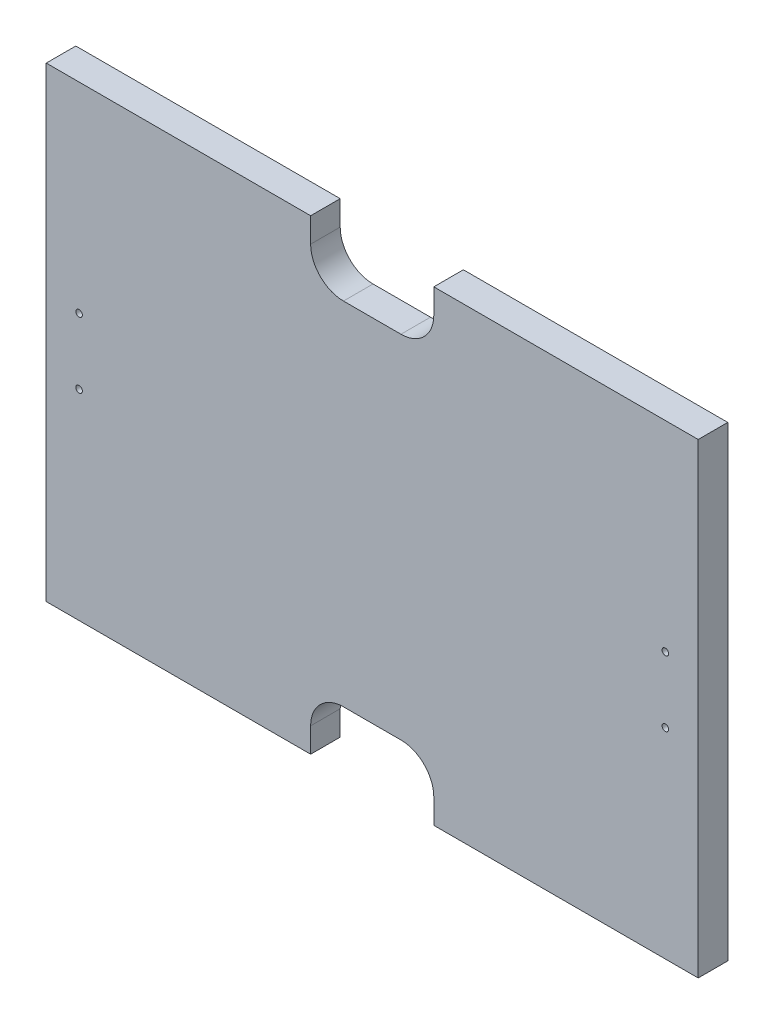
ISO-10303-21;
HEADER;
FILE_DESCRIPTION(('STEP AP214'),'2;1');
FILE_NAME('part.step','',(''),(''),'','','');
FILE_SCHEMA(('AUTOMOTIVE_DESIGN { 1 0 10303 214 1 1 1 1 }'));
ENDSEC;
DATA;
#1=APPLICATION_CONTEXT('core data for automotive mechanical design processes');
#2=APPLICATION_PROTOCOL_DEFINITION('international standard','automotive_design',2000,#1);
#3=PRODUCT_CONTEXT('',#1,'mechanical');
#4=PRODUCT('Part','Part','',(#3));
#5=PRODUCT_RELATED_PRODUCT_CATEGORY('part','',(#4));
#6=PRODUCT_DEFINITION_FORMATION('','',#4);
#7=PRODUCT_DEFINITION_CONTEXT('part definition',#1,'design');
#8=PRODUCT_DEFINITION('design','',#6,#7);
#9=PRODUCT_DEFINITION_SHAPE('','',#8);
#10=(LENGTH_UNIT() NAMED_UNIT(*) SI_UNIT(.MILLI.,.METRE.));
#11=(NAMED_UNIT(*) PLANE_ANGLE_UNIT() SI_UNIT($,.RADIAN.));
#12=(NAMED_UNIT(*) SI_UNIT($,.STERADIAN.) SOLID_ANGLE_UNIT());
#13=UNCERTAINTY_MEASURE_WITH_UNIT(LENGTH_MEASURE(1.E-05),#10,'distance_accuracy_value','');
#14=(GEOMETRIC_REPRESENTATION_CONTEXT(3) GLOBAL_UNCERTAINTY_ASSIGNED_CONTEXT((#13)) GLOBAL_UNIT_ASSIGNED_CONTEXT((#10,
#11,#12)) REPRESENTATION_CONTEXT('',''));
#15=CARTESIAN_POINT('',(0.,0.,0.));
#16=DIRECTION('',(0.,0.,1.));
#17=DIRECTION('',(1.,0.,0.));
#18=AXIS2_PLACEMENT_3D('',#15,#16,#17);
#19=CARTESIAN_POINT('',(0.,0.,18.));
#20=DIRECTION('',(0.,1.,0.));
#21=DIRECTION('',(0.,0.,1.));
#22=AXIS2_PLACEMENT_3D('',#19,#20,#21);
#23=PLANE('',#22);
#24=DIRECTION('',(1.,0.,0.));
#25=VECTOR('',#24,1.);
#26=CARTESIAN_POINT('',(0.,0.,0.));
#27=LINE('',#26,#25);
#28=CARTESIAN_POINT('',(0.,0.,0.));
#29=VERTEX_POINT('',#28);
#30=CARTESIAN_POINT('',(161.,0.,0.));
#31=VERTEX_POINT('',#30);
#32=EDGE_CURVE('E208',#29,#31,#27,.T.);
#33=ORIENTED_EDGE('',*,*,#32,.T.);
#34=DIRECTION('',(0.,0.,1.));
#35=VECTOR('',#34,1.);
#36=CARTESIAN_POINT('',(161.,0.,0.));
#37=LINE('',#36,#35);
#38=CARTESIAN_POINT('',(161.,0.,18.));
#39=VERTEX_POINT('',#38);
#40=EDGE_CURVE('E251',#31,#39,#37,.T.);
#41=ORIENTED_EDGE('',*,*,#40,.T.);
#42=DIRECTION('',(1.,0.,0.));
#43=VECTOR('',#42,1.);
#44=CARTESIAN_POINT('',(0.,0.,18.));
#45=LINE('',#44,#43);
#46=CARTESIAN_POINT('',(0.,0.,18.));
#47=VERTEX_POINT('',#46);
#48=EDGE_CURVE('E220',#47,#39,#45,.T.);
#49=ORIENTED_EDGE('',*,*,#48,.F.);
#50=DIRECTION('',(0.,0.,-1.));
#51=VECTOR('',#50,1.);
#52=CARTESIAN_POINT('',(0.,0.,18.));
#53=LINE('',#52,#51);
#54=EDGE_CURVE('E11',#47,#29,#53,.T.);
#55=ORIENTED_EDGE('',*,*,#54,.T.);
#56=EDGE_LOOP('',(#33,#41,#49,#55));
#57=FACE_BOUND('',#56,.T.);
#58=ADVANCED_FACE('F41',(#57),#23,.F.);
#59=CARTESIAN_POINT('',(0.,284.,18.));
#60=DIRECTION('',(0.,-1.,0.));
#61=DIRECTION('',(0.,0.,-1.));
#62=AXIS2_PLACEMENT_3D('',#59,#60,#61);
#63=PLANE('',#62);
#64=DIRECTION('',(-1.,0.,0.));
#65=VECTOR('',#64,1.);
#66=CARTESIAN_POINT('',(0.,284.,0.));
#67=LINE('',#66,#65);
#68=CARTESIAN_POINT('',(397.,284.,0.));
#69=VERTEX_POINT('',#68);
#70=CARTESIAN_POINT('',(236.,284.,0.));
#71=VERTEX_POINT('',#70);
#72=EDGE_CURVE('E173',#69,#71,#67,.T.);
#73=ORIENTED_EDGE('',*,*,#72,.T.);
#74=DIRECTION('',(0.,0.,1.));
#75=VECTOR('',#74,1.);
#76=CARTESIAN_POINT('',(236.,284.,0.));
#77=LINE('',#76,#75);
#78=CARTESIAN_POINT('',(236.,284.,18.));
#79=VERTEX_POINT('',#78);
#80=EDGE_CURVE('E154',#71,#79,#77,.T.);
#81=ORIENTED_EDGE('',*,*,#80,.T.);
#82=DIRECTION('',(-1.,0.,0.));
#83=VECTOR('',#82,1.);
#84=CARTESIAN_POINT('',(0.,284.,18.));
#85=LINE('',#84,#83);
#86=CARTESIAN_POINT('',(397.,284.,18.));
#87=VERTEX_POINT('',#86);
#88=EDGE_CURVE('E196',#87,#79,#85,.T.);
#89=ORIENTED_EDGE('',*,*,#88,.F.);
#90=DIRECTION('',(0.,0.,-1.));
#91=VECTOR('',#90,1.);
#92=CARTESIAN_POINT('',(397.,284.,18.));
#93=LINE('',#92,#91);
#94=EDGE_CURVE('E182',#87,#69,#93,.T.);
#95=ORIENTED_EDGE('',*,*,#94,.T.);
#96=EDGE_LOOP('',(#73,#81,#89,#95));
#97=FACE_BOUND('',#96,.T.);
#98=ADVANCED_FACE('F180',(#97),#63,.F.);
#99=CARTESIAN_POINT('',(0.,0.,18.));
#100=DIRECTION('',(1.,0.,0.));
#101=DIRECTION('',(0.,0.,-1.));
#102=AXIS2_PLACEMENT_3D('',#99,#100,#101);
#103=PLANE('',#102);
#104=DIRECTION('',(0.,-1.,0.));
#105=VECTOR('',#104,1.);
#106=CARTESIAN_POINT('',(0.,0.,0.));
#107=LINE('',#106,#105);
#108=CARTESIAN_POINT('',(0.,284.,0.));
#109=VERTEX_POINT('',#108);
#110=EDGE_CURVE('E212',#109,#29,#107,.T.);
#111=ORIENTED_EDGE('',*,*,#110,.T.);
#112=ORIENTED_EDGE('',*,*,#54,.F.);
#113=DIRECTION('',(0.,-1.,0.));
#114=VECTOR('',#113,1.);
#115=CARTESIAN_POINT('',(0.,0.,18.));
#116=LINE('',#115,#114);
#117=CARTESIAN_POINT('',(0.,284.,18.));
#118=VERTEX_POINT('',#117);
#119=EDGE_CURVE('E183',#118,#47,#116,.T.);
#120=ORIENTED_EDGE('',*,*,#119,.F.);
#121=DIRECTION('',(0.,0.,-1.));
#122=VECTOR('',#121,1.);
#123=CARTESIAN_POINT('',(0.,284.,18.));
#124=LINE('',#123,#122);
#125=EDGE_CURVE('E193',#118,#109,#124,.T.);
#126=ORIENTED_EDGE('',*,*,#125,.T.);
#127=EDGE_LOOP('',(#111,#112,#120,#126));
#128=FACE_BOUND('',#127,.T.);
#129=ADVANCED_FACE('F43',(#128),#103,.F.);
#130=CARTESIAN_POINT('',(236.,0.,18.));
#131=VERTEX_POINT('',#130);
#132=CARTESIAN_POINT('',(397.,0.,18.));
#133=VERTEX_POINT('',#132);
#134=EDGE_CURVE('E187',#131,#133,#45,.T.);
#135=ORIENTED_EDGE('',*,*,#134,.F.);
#136=DIRECTION('',(0.,0.,1.));
#137=VECTOR('',#136,1.);
#138=CARTESIAN_POINT('',(236.,0.,0.));
#139=LINE('',#138,#137);
#140=CARTESIAN_POINT('',(236.,0.,0.));
#141=VERTEX_POINT('',#140);
#142=EDGE_CURVE('E236',#141,#131,#139,.T.);
#143=ORIENTED_EDGE('',*,*,#142,.F.);
#144=CARTESIAN_POINT('',(397.,0.,0.));
#145=VERTEX_POINT('',#144);
#146=EDGE_CURVE('E207',#141,#145,#27,.T.);
#147=ORIENTED_EDGE('',*,*,#146,.T.);
#148=DIRECTION('',(0.,0.,-1.));
#149=VECTOR('',#148,1.);
#150=CARTESIAN_POINT('',(397.,0.,18.));
#151=LINE('',#150,#149);
#152=EDGE_CURVE('E49',#133,#145,#151,.T.);
#153=ORIENTED_EDGE('',*,*,#152,.F.);
#154=EDGE_LOOP('',(#135,#143,#147,#153));
#155=FACE_BOUND('',#154,.T.);
#156=ADVANCED_FACE('F336',(#155),#23,.F.);
#157=CARTESIAN_POINT('',(397.,0.,18.));
#158=DIRECTION('',(-1.,0.,0.));
#159=DIRECTION('',(0.,0.,1.));
#160=AXIS2_PLACEMENT_3D('',#157,#158,#159);
#161=PLANE('',#160);
#162=DIRECTION('',(0.,1.,0.));
#163=VECTOR('',#162,1.);
#164=CARTESIAN_POINT('',(397.,0.,0.));
#165=LINE('',#164,#163);
#166=EDGE_CURVE('E189',#145,#69,#165,.T.);
#167=ORIENTED_EDGE('',*,*,#166,.T.);
#168=ORIENTED_EDGE('',*,*,#94,.F.);
#169=DIRECTION('',(0.,1.,0.));
#170=VECTOR('',#169,1.);
#171=CARTESIAN_POINT('',(397.,0.,18.));
#172=LINE('',#171,#170);
#173=EDGE_CURVE('E202',#133,#87,#172,.T.);
#174=ORIENTED_EDGE('',*,*,#173,.F.);
#175=ORIENTED_EDGE('',*,*,#152,.T.);
#176=EDGE_LOOP('',(#167,#168,#174,#175));
#177=FACE_BOUND('',#176,.T.);
#178=ADVANCED_FACE('F201',(#177),#161,.F.);
#179=CARTESIAN_POINT('',(161.,284.,18.));
#180=VERTEX_POINT('',#179);
#181=EDGE_CURVE('E218',#180,#118,#85,.T.);
#182=ORIENTED_EDGE('',*,*,#181,.F.);
#183=DIRECTION('',(0.,0.,1.));
#184=VECTOR('',#183,1.);
#185=CARTESIAN_POINT('',(161.,284.,0.));
#186=LINE('',#185,#184);
#187=CARTESIAN_POINT('',(161.,284.,0.));
#188=VERTEX_POINT('',#187);
#189=EDGE_CURVE('E165',#188,#180,#186,.T.);
#190=ORIENTED_EDGE('',*,*,#189,.F.);
#191=EDGE_CURVE('E184',#188,#109,#67,.T.);
#192=ORIENTED_EDGE('',*,*,#191,.T.);
#193=ORIENTED_EDGE('',*,*,#125,.F.);
#194=EDGE_LOOP('',(#182,#190,#192,#193));
#195=FACE_BOUND('',#194,.T.);
#196=ADVANCED_FACE('F318',(#195),#63,.F.);
#197=CARTESIAN_POINT('',(0.,0.,18.));
#198=DIRECTION('',(0.,0.,-1.));
#199=DIRECTION('',(-1.,0.,0.));
#200=AXIS2_PLACEMENT_3D('',#197,#198,#199);
#201=PLANE('',#200);
#202=CARTESIAN_POINT('',(20.,162.,18.));
#203=DIRECTION('',(0.,0.,1.));
#204=DIRECTION('',(1.,0.,0.));
#205=AXIS2_PLACEMENT_3D('',#202,#203,#204);
#206=CIRCLE('',#205,2.);
#207=CARTESIAN_POINT('',(22.,162.,18.));
#208=VERTEX_POINT('',#207);
#209=EDGE_CURVE('E282',#208,#208,#206,.T.);
#210=ORIENTED_EDGE('',*,*,#209,.F.);
#211=EDGE_LOOP('',(#210));
#212=FACE_BOUND('',#211,.T.);
#213=CARTESIAN_POINT('',(20.,122.,18.));
#214=DIRECTION('',(0.,0.,1.));
#215=DIRECTION('',(1.,0.,0.));
#216=AXIS2_PLACEMENT_3D('',#213,#214,#215);
#217=CIRCLE('',#216,2.);
#218=CARTESIAN_POINT('',(22.,122.,18.));
#219=VERTEX_POINT('',#218);
#220=EDGE_CURVE('E276',#219,#219,#217,.T.);
#221=ORIENTED_EDGE('',*,*,#220,.F.);
#222=EDGE_LOOP('',(#221));
#223=FACE_BOUND('',#222,.T.);
#224=CARTESIAN_POINT('',(377.,122.,18.));
#225=DIRECTION('',(0.,0.,1.));
#226=DIRECTION('',(-1.,0.,0.));
#227=AXIS2_PLACEMENT_3D('',#224,#225,#226);
#228=CIRCLE('',#227,2.00000000000005);
#229=CARTESIAN_POINT('',(375.,122.,18.));
#230=VERTEX_POINT('',#229);
#231=EDGE_CURVE('E270',#230,#230,#228,.T.);
#232=ORIENTED_EDGE('',*,*,#231,.F.);
#233=EDGE_LOOP('',(#232));
#234=FACE_BOUND('',#233,.T.);
#235=CARTESIAN_POINT('',(377.,162.,18.));
#236=DIRECTION('',(0.,0.,1.));
#237=DIRECTION('',(-1.,0.,0.));
#238=AXIS2_PLACEMENT_3D('',#235,#236,#237);
#239=CIRCLE('',#238,2.00000000000006);
#240=CARTESIAN_POINT('',(375.,162.,18.));
#241=VERTEX_POINT('',#240);
#242=EDGE_CURVE('E264',#241,#241,#239,.T.);
#243=ORIENTED_EDGE('',*,*,#242,.F.);
#244=EDGE_LOOP('',(#243));
#245=FACE_BOUND('',#244,.T.);
#246=ORIENTED_EDGE('',*,*,#88,.T.);
#247=DIRECTION('',(0.,1.,0.));
#248=VECTOR('',#247,1.);
#249=CARTESIAN_POINT('',(236.,284.,18.));
#250=LINE('',#249,#248);
#251=CARTESIAN_POINT('',(236.,269.,18.));
#252=VERTEX_POINT('',#251);
#253=EDGE_CURVE('E160',#252,#79,#250,.T.);
#254=ORIENTED_EDGE('',*,*,#253,.F.);
#255=CARTESIAN_POINT('',(216.,269.,18.));
#256=DIRECTION('',(0.,0.,1.));
#257=DIRECTION('',(-1.,0.,0.));
#258=AXIS2_PLACEMENT_3D('',#255,#256,#257);
#259=CIRCLE('',#258,20.);
#260=CARTESIAN_POINT('',(216.,249.,18.));
#261=VERTEX_POINT('',#260);
#262=EDGE_CURVE('E177',#261,#252,#259,.T.);
#263=ORIENTED_EDGE('',*,*,#262,.F.);
#264=DIRECTION('',(1.,0.,0.));
#265=VECTOR('',#264,1.);
#266=CARTESIAN_POINT('',(216.,249.,18.));
#267=LINE('',#266,#265);
#268=CARTESIAN_POINT('',(181.,249.,18.));
#269=VERTEX_POINT('',#268);
#270=EDGE_CURVE('E295',#269,#261,#267,.T.);
#271=ORIENTED_EDGE('',*,*,#270,.F.);
#272=CARTESIAN_POINT('',(181.,269.,18.));
#273=DIRECTION('',(0.,0.,1.));
#274=DIRECTION('',(-1.,0.,0.));
#275=AXIS2_PLACEMENT_3D('',#272,#273,#274);
#276=CIRCLE('',#275,20.);
#277=CARTESIAN_POINT('',(161.,269.,18.));
#278=VERTEX_POINT('',#277);
#279=EDGE_CURVE('E298',#278,#269,#276,.T.);
#280=ORIENTED_EDGE('',*,*,#279,.F.);
#281=DIRECTION('',(0.,-1.,0.));
#282=VECTOR('',#281,1.);
#283=CARTESIAN_POINT('',(161.,284.,18.));
#284=LINE('',#283,#282);
#285=EDGE_CURVE('E301',#180,#278,#284,.T.);
#286=ORIENTED_EDGE('',*,*,#285,.F.);
#287=ORIENTED_EDGE('',*,*,#181,.T.);
#288=ORIENTED_EDGE('',*,*,#119,.T.);
#289=ORIENTED_EDGE('',*,*,#48,.T.);
#290=DIRECTION('',(0.,-1.,0.));
#291=VECTOR('',#290,1.);
#292=CARTESIAN_POINT('',(161.,0.,18.));
#293=LINE('',#292,#291);
#294=CARTESIAN_POINT('',(161.,14.9999999999999,18.));
#295=VERTEX_POINT('',#294);
#296=EDGE_CURVE('E225',#295,#39,#293,.T.);
#297=ORIENTED_EDGE('',*,*,#296,.F.);
#298=CARTESIAN_POINT('',(181.,15.,18.));
#299=DIRECTION('',(0.,0.,1.));
#300=DIRECTION('',(1.,0.,0.));
#301=AXIS2_PLACEMENT_3D('',#298,#299,#300);
#302=CIRCLE('',#301,20.);
#303=CARTESIAN_POINT('',(181.,35.,18.));
#304=VERTEX_POINT('',#303);
#305=EDGE_CURVE('E247',#304,#295,#302,.T.);
#306=ORIENTED_EDGE('',*,*,#305,.F.);
#307=DIRECTION('',(-1.,0.,0.));
#308=VECTOR('',#307,1.);
#309=CARTESIAN_POINT('',(216.,35.,18.));
#310=LINE('',#309,#308);
#311=CARTESIAN_POINT('',(216.,35.,18.));
#312=VERTEX_POINT('',#311);
#313=EDGE_CURVE('E244',#312,#304,#310,.T.);
#314=ORIENTED_EDGE('',*,*,#313,.F.);
#315=CARTESIAN_POINT('',(216.,15.,18.));
#316=DIRECTION('',(0.,0.,1.));
#317=DIRECTION('',(-1.,0.,0.));
#318=AXIS2_PLACEMENT_3D('',#315,#316,#317);
#319=CIRCLE('',#318,20.);
#320=CARTESIAN_POINT('',(236.,14.9999999999999,18.));
#321=VERTEX_POINT('',#320);
#322=EDGE_CURVE('E241',#321,#312,#319,.T.);
#323=ORIENTED_EDGE('',*,*,#322,.F.);
#324=DIRECTION('',(0.,1.,0.));
#325=VECTOR('',#324,1.);
#326=CARTESIAN_POINT('',(236.,0.,18.));
#327=LINE('',#326,#325);
#328=EDGE_CURVE('E237',#131,#321,#327,.T.);
#329=ORIENTED_EDGE('',*,*,#328,.F.);
#330=ORIENTED_EDGE('',*,*,#134,.T.);
#331=ORIENTED_EDGE('',*,*,#173,.T.);
#332=EDGE_LOOP('',(#246,#254,#263,#271,#280,#286,#287,#288,#289,#297,#306,#314,#323,#329,#330,#331));
#333=FACE_BOUND('',#332,.T.);
#334=ADVANCED_FACE('F322',(#212,#223,#234,#245,#333),#201,.F.);
#335=CARTESIAN_POINT('',(0.,0.,0.));
#336=DIRECTION('',(0.,0.,-1.));
#337=DIRECTION('',(-1.,0.,0.));
#338=AXIS2_PLACEMENT_3D('',#335,#336,#337);
#339=PLANE('',#338);
#340=DIRECTION('',(0.,1.,0.));
#341=VECTOR('',#340,1.);
#342=CARTESIAN_POINT('',(236.,284.,0.));
#343=LINE('',#342,#341);
#344=CARTESIAN_POINT('',(236.,269.,0.));
#345=VERTEX_POINT('',#344);
#346=EDGE_CURVE('E157',#345,#71,#343,.T.);
#347=ORIENTED_EDGE('',*,*,#346,.T.);
#348=ORIENTED_EDGE('',*,*,#72,.F.);
#349=ORIENTED_EDGE('',*,*,#166,.F.);
#350=ORIENTED_EDGE('',*,*,#146,.F.);
#351=DIRECTION('',(0.,1.,0.));
#352=VECTOR('',#351,1.);
#353=CARTESIAN_POINT('',(236.,0.,0.));
#354=LINE('',#353,#352);
#355=CARTESIAN_POINT('',(236.,14.9999999999999,0.));
#356=VERTEX_POINT('',#355);
#357=EDGE_CURVE('E223',#141,#356,#354,.T.);
#358=ORIENTED_EDGE('',*,*,#357,.T.);
#359=CARTESIAN_POINT('',(216.,15.,0.));
#360=DIRECTION('',(0.,0.,1.));
#361=DIRECTION('',(-1.,0.,0.));
#362=AXIS2_PLACEMENT_3D('',#359,#360,#361);
#363=CIRCLE('',#362,20.);
#364=CARTESIAN_POINT('',(216.,35.,0.));
#365=VERTEX_POINT('',#364);
#366=EDGE_CURVE('E64',#356,#365,#363,.T.);
#367=ORIENTED_EDGE('',*,*,#366,.T.);
#368=DIRECTION('',(-1.,0.,0.));
#369=VECTOR('',#368,1.);
#370=CARTESIAN_POINT('',(216.,35.,0.));
#371=LINE('',#370,#369);
#372=CARTESIAN_POINT('',(181.,35.,0.));
#373=VERTEX_POINT('',#372);
#374=EDGE_CURVE('E227',#365,#373,#371,.T.);
#375=ORIENTED_EDGE('',*,*,#374,.T.);
#376=CARTESIAN_POINT('',(181.,15.,0.));
#377=DIRECTION('',(0.,0.,1.));
#378=DIRECTION('',(1.,0.,0.));
#379=AXIS2_PLACEMENT_3D('',#376,#377,#378);
#380=CIRCLE('',#379,20.);
#381=CARTESIAN_POINT('',(161.,14.9999999999999,0.));
#382=VERTEX_POINT('',#381);
#383=EDGE_CURVE('E230',#373,#382,#380,.T.);
#384=ORIENTED_EDGE('',*,*,#383,.T.);
#385=DIRECTION('',(0.,-1.,0.));
#386=VECTOR('',#385,1.);
#387=CARTESIAN_POINT('',(161.,0.,0.));
#388=LINE('',#387,#386);
#389=EDGE_CURVE('E233',#382,#31,#388,.T.);
#390=ORIENTED_EDGE('',*,*,#389,.T.);
#391=ORIENTED_EDGE('',*,*,#32,.F.);
#392=ORIENTED_EDGE('',*,*,#110,.F.);
#393=ORIENTED_EDGE('',*,*,#191,.F.);
#394=DIRECTION('',(0.,-1.,0.));
#395=VECTOR('',#394,1.);
#396=CARTESIAN_POINT('',(161.,284.,0.));
#397=LINE('',#396,#395);
#398=CARTESIAN_POINT('',(161.,269.,0.));
#399=VERTEX_POINT('',#398);
#400=EDGE_CURVE('E176',#188,#399,#397,.T.);
#401=ORIENTED_EDGE('',*,*,#400,.T.);
#402=CARTESIAN_POINT('',(181.,269.,0.));
#403=DIRECTION('',(0.,0.,1.));
#404=DIRECTION('',(-1.,0.,0.));
#405=AXIS2_PLACEMENT_3D('',#402,#403,#404);
#406=CIRCLE('',#405,20.);
#407=CARTESIAN_POINT('',(181.,249.,0.));
#408=VERTEX_POINT('',#407);
#409=EDGE_CURVE('E56',#399,#408,#406,.T.);
#410=ORIENTED_EDGE('',*,*,#409,.T.);
#411=DIRECTION('',(1.,0.,0.));
#412=VECTOR('',#411,1.);
#413=CARTESIAN_POINT('',(216.,249.,0.));
#414=LINE('',#413,#412);
#415=CARTESIAN_POINT('',(216.,249.,0.));
#416=VERTEX_POINT('',#415);
#417=EDGE_CURVE('E306',#408,#416,#414,.T.);
#418=ORIENTED_EDGE('',*,*,#417,.T.);
#419=CARTESIAN_POINT('',(216.,269.,0.));
#420=DIRECTION('',(0.,0.,1.));
#421=DIRECTION('',(-1.,0.,0.));
#422=AXIS2_PLACEMENT_3D('',#419,#420,#421);
#423=CIRCLE('',#422,20.);
#424=EDGE_CURVE('E166',#416,#345,#423,.T.);
#425=ORIENTED_EDGE('',*,*,#424,.T.);
#426=EDGE_LOOP('',(#347,#348,#349,#350,#358,#367,#375,#384,#390,#391,#392,#393,#401,#410,#418,#425));
#427=FACE_BOUND('',#426,.T.);
#428=CARTESIAN_POINT('',(20.,162.,0.));
#429=DIRECTION('',(0.,0.,1.));
#430=DIRECTION('',(1.,0.,0.));
#431=AXIS2_PLACEMENT_3D('',#428,#429,#430);
#432=CIRCLE('',#431,2.);
#433=CARTESIAN_POINT('',(22.,162.,0.));
#434=VERTEX_POINT('',#433);
#435=EDGE_CURVE('E279',#434,#434,#432,.T.);
#436=ORIENTED_EDGE('',*,*,#435,.T.);
#437=EDGE_LOOP('',(#436));
#438=FACE_BOUND('',#437,.T.);
#439=CARTESIAN_POINT('',(20.,122.,0.));
#440=DIRECTION('',(0.,0.,1.));
#441=DIRECTION('',(1.,0.,0.));
#442=AXIS2_PLACEMENT_3D('',#439,#440,#441);
#443=CIRCLE('',#442,2.);
#444=CARTESIAN_POINT('',(22.,122.,0.));
#445=VERTEX_POINT('',#444);
#446=EDGE_CURVE('E273',#445,#445,#443,.T.);
#447=ORIENTED_EDGE('',*,*,#446,.T.);
#448=EDGE_LOOP('',(#447));
#449=FACE_BOUND('',#448,.T.);
#450=CARTESIAN_POINT('',(377.,122.,0.));
#451=DIRECTION('',(0.,0.,1.));
#452=DIRECTION('',(-1.,0.,0.));
#453=AXIS2_PLACEMENT_3D('',#450,#451,#452);
#454=CIRCLE('',#453,2.00000000000005);
#455=CARTESIAN_POINT('',(375.,122.,0.));
#456=VERTEX_POINT('',#455);
#457=EDGE_CURVE('E267',#456,#456,#454,.T.);
#458=ORIENTED_EDGE('',*,*,#457,.T.);
#459=EDGE_LOOP('',(#458));
#460=FACE_BOUND('',#459,.T.);
#461=CARTESIAN_POINT('',(377.,162.,0.));
#462=DIRECTION('',(0.,0.,1.));
#463=DIRECTION('',(-1.,0.,0.));
#464=AXIS2_PLACEMENT_3D('',#461,#462,#463);
#465=CIRCLE('',#464,2.00000000000006);
#466=CARTESIAN_POINT('',(375.,162.,0.));
#467=VERTEX_POINT('',#466);
#468=EDGE_CURVE('E240',#467,#467,#465,.T.);
#469=ORIENTED_EDGE('',*,*,#468,.T.);
#470=EDGE_LOOP('',(#469));
#471=FACE_BOUND('',#470,.T.);
#472=ADVANCED_FACE('F170',(#427,#438,#449,#460,#471),#339,.T.);
#473=CARTESIAN_POINT('',(161.,0.,0.));
#474=DIRECTION('',(-1.,0.,0.));
#475=DIRECTION('',(0.,0.,1.));
#476=AXIS2_PLACEMENT_3D('',#473,#474,#475);
#477=PLANE('',#476);
#478=ORIENTED_EDGE('',*,*,#296,.T.);
#479=ORIENTED_EDGE('',*,*,#40,.F.);
#480=ORIENTED_EDGE('',*,*,#389,.F.);
#481=DIRECTION('',(0.,0.,1.));
#482=VECTOR('',#481,1.);
#483=CARTESIAN_POINT('',(161.,14.9999999999999,0.));
#484=LINE('',#483,#482);
#485=EDGE_CURVE('E253',#382,#295,#484,.T.);
#486=ORIENTED_EDGE('',*,*,#485,.T.);
#487=EDGE_LOOP('',(#478,#479,#480,#486));
#488=FACE_BOUND('',#487,.T.);
#489=ADVANCED_FACE('F350',(#488),#477,.F.);
#490=CARTESIAN_POINT('',(181.,15.,0.));
#491=DIRECTION('',(0.,0.,1.));
#492=DIRECTION('',(1.,0.,0.));
#493=AXIS2_PLACEMENT_3D('',#490,#491,#492);
#494=CYLINDRICAL_SURFACE('',#493,20.);
#495=ORIENTED_EDGE('',*,*,#305,.T.);
#496=ORIENTED_EDGE('',*,*,#485,.F.);
#497=ORIENTED_EDGE('',*,*,#383,.F.);
#498=DIRECTION('',(0.,0.,1.));
#499=VECTOR('',#498,1.);
#500=CARTESIAN_POINT('',(181.,35.,0.));
#501=LINE('',#500,#499);
#502=EDGE_CURVE('E255',#373,#304,#501,.T.);
#503=ORIENTED_EDGE('',*,*,#502,.T.);
#504=EDGE_LOOP('',(#495,#496,#497,#503));
#505=FACE_BOUND('',#504,.T.);
#506=ADVANCED_FACE('F346',(#505),#494,.F.);
#507=CARTESIAN_POINT('',(216.,35.,0.));
#508=DIRECTION('',(0.,1.,0.));
#509=DIRECTION('',(0.,0.,1.));
#510=AXIS2_PLACEMENT_3D('',#507,#508,#509);
#511=PLANE('',#510);
#512=ORIENTED_EDGE('',*,*,#313,.T.);
#513=ORIENTED_EDGE('',*,*,#502,.F.);
#514=ORIENTED_EDGE('',*,*,#374,.F.);
#515=DIRECTION('',(0.,0.,1.));
#516=VECTOR('',#515,1.);
#517=CARTESIAN_POINT('',(216.,35.,0.));
#518=LINE('',#517,#516);
#519=EDGE_CURVE('E257',#365,#312,#518,.T.);
#520=ORIENTED_EDGE('',*,*,#519,.T.);
#521=EDGE_LOOP('',(#512,#513,#514,#520));
#522=FACE_BOUND('',#521,.T.);
#523=ADVANCED_FACE('F342',(#522),#511,.F.);
#524=CARTESIAN_POINT('',(216.,15.,0.));
#525=DIRECTION('',(0.,0.,1.));
#526=DIRECTION('',(1.,0.,0.));
#527=AXIS2_PLACEMENT_3D('',#524,#525,#526);
#528=CYLINDRICAL_SURFACE('',#527,20.);
#529=ORIENTED_EDGE('',*,*,#322,.T.);
#530=ORIENTED_EDGE('',*,*,#519,.F.);
#531=ORIENTED_EDGE('',*,*,#366,.F.);
#532=DIRECTION('',(0.,0.,1.));
#533=VECTOR('',#532,1.);
#534=CARTESIAN_POINT('',(236.,14.9999999999999,0.));
#535=LINE('',#534,#533);
#536=EDGE_CURVE('E259',#356,#321,#535,.T.);
#537=ORIENTED_EDGE('',*,*,#536,.T.);
#538=EDGE_LOOP('',(#529,#530,#531,#537));
#539=FACE_BOUND('',#538,.T.);
#540=ADVANCED_FACE('F376',(#539),#528,.F.);
#541=CARTESIAN_POINT('',(236.,0.,0.));
#542=DIRECTION('',(1.,0.,0.));
#543=DIRECTION('',(0.,0.,-1.));
#544=AXIS2_PLACEMENT_3D('',#541,#542,#543);
#545=PLANE('',#544);
#546=ORIENTED_EDGE('',*,*,#328,.T.);
#547=ORIENTED_EDGE('',*,*,#536,.F.);
#548=ORIENTED_EDGE('',*,*,#357,.F.);
#549=ORIENTED_EDGE('',*,*,#142,.T.);
#550=EDGE_LOOP('',(#546,#547,#548,#549));
#551=FACE_BOUND('',#550,.T.);
#552=ADVANCED_FACE('F338',(#551),#545,.F.);
#553=CARTESIAN_POINT('',(377.,162.,0.));
#554=DIRECTION('',(0.,0.,1.));
#555=DIRECTION('',(1.,0.,0.));
#556=AXIS2_PLACEMENT_3D('',#553,#554,#555);
#557=CYLINDRICAL_SURFACE('',#556,2.00000000000006);
#558=ORIENTED_EDGE('',*,*,#468,.F.);
#559=EDGE_LOOP('',(#558));
#560=FACE_BOUND('',#559,.T.);
#561=ORIENTED_EDGE('',*,*,#242,.T.);
#562=EDGE_LOOP('',(#561));
#563=FACE_BOUND('',#562,.T.);
#564=ADVANCED_FACE('F381',(#560,#563),#557,.F.);
#565=CARTESIAN_POINT('',(377.,122.,0.));
#566=DIRECTION('',(0.,0.,1.));
#567=DIRECTION('',(1.,0.,0.));
#568=AXIS2_PLACEMENT_3D('',#565,#566,#567);
#569=CYLINDRICAL_SURFACE('',#568,2.00000000000005);
#570=ORIENTED_EDGE('',*,*,#457,.F.);
#571=EDGE_LOOP('',(#570));
#572=FACE_BOUND('',#571,.T.);
#573=ORIENTED_EDGE('',*,*,#231,.T.);
#574=EDGE_LOOP('',(#573));
#575=FACE_BOUND('',#574,.T.);
#576=ADVANCED_FACE('F384',(#572,#575),#569,.F.);
#577=CARTESIAN_POINT('',(20.,122.,0.));
#578=DIRECTION('',(0.,0.,1.));
#579=DIRECTION('',(1.,0.,0.));
#580=AXIS2_PLACEMENT_3D('',#577,#578,#579);
#581=CYLINDRICAL_SURFACE('',#580,2.);
#582=ORIENTED_EDGE('',*,*,#446,.F.);
#583=EDGE_LOOP('',(#582));
#584=FACE_BOUND('',#583,.T.);
#585=ORIENTED_EDGE('',*,*,#220,.T.);
#586=EDGE_LOOP('',(#585));
#587=FACE_BOUND('',#586,.T.);
#588=ADVANCED_FACE('F388',(#584,#587),#581,.F.);
#589=CARTESIAN_POINT('',(20.,162.,0.));
#590=DIRECTION('',(0.,0.,1.));
#591=DIRECTION('',(1.,0.,0.));
#592=AXIS2_PLACEMENT_3D('',#589,#590,#591);
#593=CYLINDRICAL_SURFACE('',#592,2.);
#594=ORIENTED_EDGE('',*,*,#435,.F.);
#595=EDGE_LOOP('',(#594));
#596=FACE_BOUND('',#595,.T.);
#597=ORIENTED_EDGE('',*,*,#209,.T.);
#598=EDGE_LOOP('',(#597));
#599=FACE_BOUND('',#598,.T.);
#600=ADVANCED_FACE('F392',(#596,#599),#593,.F.);
#601=CARTESIAN_POINT('',(236.,284.,0.));
#602=DIRECTION('',(1.,0.,0.));
#603=DIRECTION('',(0.,0.,-1.));
#604=AXIS2_PLACEMENT_3D('',#601,#602,#603);
#605=PLANE('',#604);
#606=ORIENTED_EDGE('',*,*,#253,.T.);
#607=ORIENTED_EDGE('',*,*,#80,.F.);
#608=ORIENTED_EDGE('',*,*,#346,.F.);
#609=DIRECTION('',(0.,0.,1.));
#610=VECTOR('',#609,1.);
#611=CARTESIAN_POINT('',(236.,269.,0.));
#612=LINE('',#611,#610);
#613=EDGE_CURVE('E216',#345,#252,#612,.T.);
#614=ORIENTED_EDGE('',*,*,#613,.T.);
#615=EDGE_LOOP('',(#606,#607,#608,#614));
#616=FACE_BOUND('',#615,.T.);
#617=ADVANCED_FACE('F156',(#616),#605,.F.);
#618=CARTESIAN_POINT('',(216.,269.,0.));
#619=DIRECTION('',(0.,0.,1.));
#620=DIRECTION('',(1.,0.,0.));
#621=AXIS2_PLACEMENT_3D('',#618,#619,#620);
#622=CYLINDRICAL_SURFACE('',#621,20.);
#623=ORIENTED_EDGE('',*,*,#262,.T.);
#624=ORIENTED_EDGE('',*,*,#613,.F.);
#625=ORIENTED_EDGE('',*,*,#424,.F.);
#626=DIRECTION('',(0.,0.,1.));
#627=VECTOR('',#626,1.);
#628=CARTESIAN_POINT('',(216.,249.,0.));
#629=LINE('',#628,#627);
#630=EDGE_CURVE('E290',#416,#261,#629,.T.);
#631=ORIENTED_EDGE('',*,*,#630,.T.);
#632=EDGE_LOOP('',(#623,#624,#625,#631));
#633=FACE_BOUND('',#632,.T.);
#634=ADVANCED_FACE('F332',(#633),#622,.F.);
#635=CARTESIAN_POINT('',(216.,249.,0.));
#636=DIRECTION('',(0.,-1.,0.));
#637=DIRECTION('',(0.,0.,-1.));
#638=AXIS2_PLACEMENT_3D('',#635,#636,#637);
#639=PLANE('',#638);
#640=ORIENTED_EDGE('',*,*,#270,.T.);
#641=ORIENTED_EDGE('',*,*,#630,.F.);
#642=ORIENTED_EDGE('',*,*,#417,.F.);
#643=DIRECTION('',(0.,0.,1.));
#644=VECTOR('',#643,1.);
#645=CARTESIAN_POINT('',(181.,249.,0.));
#646=LINE('',#645,#644);
#647=EDGE_CURVE('E288',#408,#269,#646,.T.);
#648=ORIENTED_EDGE('',*,*,#647,.T.);
#649=EDGE_LOOP('',(#640,#641,#642,#648));
#650=FACE_BOUND('',#649,.T.);
#651=ADVANCED_FACE('F330',(#650),#639,.F.);
#652=CARTESIAN_POINT('',(181.,269.,0.));
#653=DIRECTION('',(0.,0.,1.));
#654=DIRECTION('',(1.,0.,0.));
#655=AXIS2_PLACEMENT_3D('',#652,#653,#654);
#656=CYLINDRICAL_SURFACE('',#655,20.);
#657=ORIENTED_EDGE('',*,*,#279,.T.);
#658=ORIENTED_EDGE('',*,*,#647,.F.);
#659=ORIENTED_EDGE('',*,*,#409,.F.);
#660=DIRECTION('',(0.,0.,1.));
#661=VECTOR('',#660,1.);
#662=CARTESIAN_POINT('',(161.,269.,0.));
#663=LINE('',#662,#661);
#664=EDGE_CURVE('E286',#399,#278,#663,.T.);
#665=ORIENTED_EDGE('',*,*,#664,.T.);
#666=EDGE_LOOP('',(#657,#658,#659,#665));
#667=FACE_BOUND('',#666,.T.);
#668=ADVANCED_FACE('F327',(#667),#656,.F.);
#669=CARTESIAN_POINT('',(161.,284.,0.));
#670=DIRECTION('',(-1.,0.,0.));
#671=DIRECTION('',(0.,0.,1.));
#672=AXIS2_PLACEMENT_3D('',#669,#670,#671);
#673=PLANE('',#672);
#674=ORIENTED_EDGE('',*,*,#285,.T.);
#675=ORIENTED_EDGE('',*,*,#664,.F.);
#676=ORIENTED_EDGE('',*,*,#400,.F.);
#677=ORIENTED_EDGE('',*,*,#189,.T.);
#678=EDGE_LOOP('',(#674,#675,#676,#677));
#679=FACE_BOUND('',#678,.T.);
#680=ADVANCED_FACE('F314',(#679),#673,.F.);
#681=CLOSED_SHELL('',(#58,#98,#129,#156,#178,#196,#334,#472,#489,#506,#523,#540,#552,#564,#576,
#588,#600,#617,#634,#651,#668,#680));
#682=MANIFOLD_SOLID_BREP('B2',#681);
#683=ADVANCED_BREP_SHAPE_REPRESENTATION('',(#18,#682),#14);
#684=SHAPE_DEFINITION_REPRESENTATION(#9,#683);
ENDSEC;
END-ISO-10303-21;
